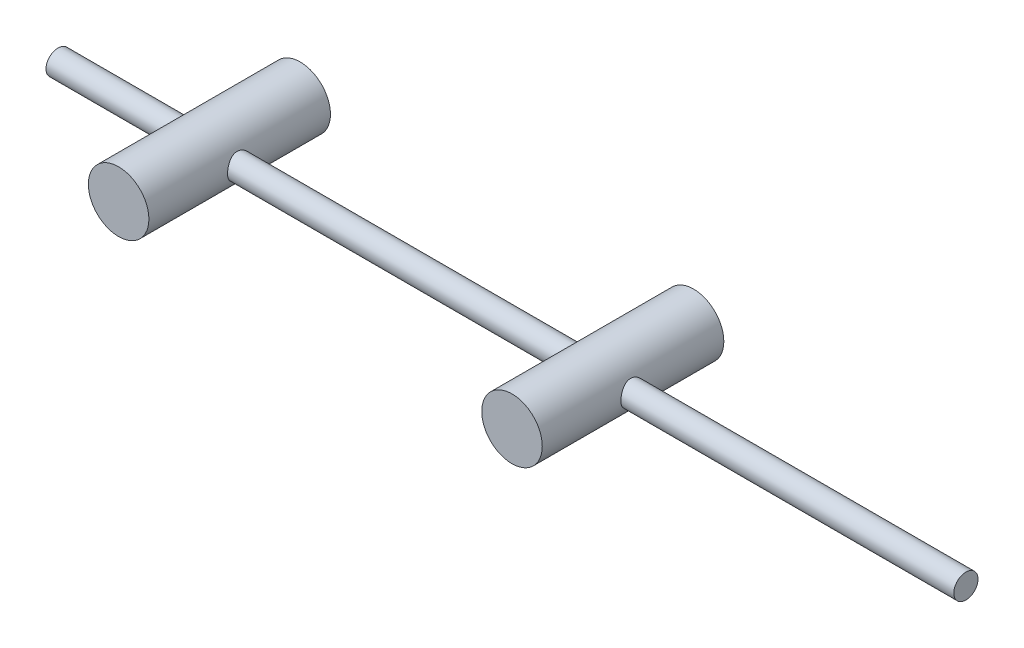
ISO-10303-21;
HEADER;
FILE_DESCRIPTION(('STEP AP214'),'2;1');
FILE_NAME('part.step','',(''),(''),'','','');
FILE_SCHEMA(('AUTOMOTIVE_DESIGN { 1 0 10303 214 1 1 1 1 }'));
ENDSEC;
DATA;
#1=APPLICATION_CONTEXT('core data for automotive mechanical design processes');
#2=APPLICATION_PROTOCOL_DEFINITION('international standard','automotive_design',2000,#1);
#3=PRODUCT_CONTEXT('',#1,'mechanical');
#4=PRODUCT('Part','Part','',(#3));
#5=PRODUCT_RELATED_PRODUCT_CATEGORY('part','',(#4));
#6=PRODUCT_DEFINITION_FORMATION('','',#4);
#7=PRODUCT_DEFINITION_CONTEXT('part definition',#1,'design');
#8=PRODUCT_DEFINITION('design','',#6,#7);
#9=PRODUCT_DEFINITION_SHAPE('','',#8);
#10=(LENGTH_UNIT() NAMED_UNIT(*) SI_UNIT(.MILLI.,.METRE.));
#11=(NAMED_UNIT(*) PLANE_ANGLE_UNIT() SI_UNIT($,.RADIAN.));
#12=(NAMED_UNIT(*) SI_UNIT($,.STERADIAN.) SOLID_ANGLE_UNIT());
#13=UNCERTAINTY_MEASURE_WITH_UNIT(LENGTH_MEASURE(1.E-05),#10,'distance_accuracy_value','');
#14=(GEOMETRIC_REPRESENTATION_CONTEXT(3) GLOBAL_UNCERTAINTY_ASSIGNED_CONTEXT((#13)) GLOBAL_UNIT_ASSIGNED_CONTEXT((#10,
#11,#12)) REPRESENTATION_CONTEXT('',''));
#15=CARTESIAN_POINT('',(0.,0.,0.));
#16=DIRECTION('',(0.,0.,1.));
#17=DIRECTION('',(1.,0.,0.));
#18=AXIS2_PLACEMENT_3D('',#15,#16,#17);
#19=CARTESIAN_POINT('',(0.,0.,0.));
#20=DIRECTION('',(-1.,0.,0.));
#21=DIRECTION('',(0.,0.,1.));
#22=AXIS2_PLACEMENT_3D('',#19,#20,#21);
#23=CYLINDRICAL_SURFACE('',#22,2.);
#24=CARTESIAN_POINT('',(85.,0.,2.));
#25=CARTESIAN_POINT('',(85.0000072877292,-0.107493005442892,1.99999014817628));
#26=CARTESIAN_POINT('',(85.0035070569307,-0.215172564090674,1.99128224791163));
#27=CARTESIAN_POINT('',(85.0171654689936,-0.427496480417897,1.95675229647877));
#28=CARTESIAN_POINT('',(85.0273422130112,-0.532131777561249,1.93088372091387));
#29=CARTESIAN_POINT('',(85.0532579078688,-0.734953922727404,1.86312392194117));
#30=CARTESIAN_POINT('',(85.0689786363593,-0.833160661616961,1.82128515378327));
#31=CARTESIAN_POINT('',(85.1044338920392,-1.02107197032837,1.72298082667346));
#32=CARTESIAN_POINT('',(85.1241670254194,-1.11077947675099,1.66652034508107));
#33=CARTESIAN_POINT('',(85.1666911382958,-1.2835010075704,1.53776450143907));
#34=CARTESIAN_POINT('',(85.1895770307081,-1.36606227255022,1.46489334375974));
#35=CARTESIAN_POINT('',(85.2353942309381,-1.51817500478473,1.30659999652322));
#36=CARTESIAN_POINT('',(85.2583255554621,-1.58772010713354,1.22117170278826));
#37=CARTESIAN_POINT('',(85.3027720820287,-1.71487456729288,1.03557192975774));
#38=CARTESIAN_POINT('',(85.3241788403505,-1.77181498119548,0.934913513976805));
#39=CARTESIAN_POINT('',(85.3616635281321,-1.86775471903715,0.72446360157996));
#40=CARTESIAN_POINT('',(85.3777439875582,-1.90676256428584,0.614676472151642));
#41=CARTESIAN_POINT('',(85.4017364233918,-1.96389882339587,0.3942876664079));
#42=CARTESIAN_POINT('',(85.409985796444,-1.98289396580565,0.283948764423788));
#43=CARTESIAN_POINT('',(85.4183599595086,-2.00217296164003,0.0613650016927327));
#44=CARTESIAN_POINT('',(85.4184887447723,-2.00246601631323,-0.0508788946250148));
#45=CARTESIAN_POINT('',(85.4108949972001,-1.98498936750455,-0.265756671458044));
#46=CARTESIAN_POINT('',(85.4037182496155,-1.96847531430514,-0.368515714409031));
#47=CARTESIAN_POINT('',(85.3832381239217,-1.91994688029782,-0.569659556006714));
#48=CARTESIAN_POINT('',(85.3699336767833,-1.88792979480464,-0.668043588110308));
#49=CARTESIAN_POINT('',(85.3384051491147,-1.80869473255108,-0.860017836196042));
#50=CARTESIAN_POINT('',(85.3200862071921,-1.76117986231532,-0.953469239054692));
#51=CARTESIAN_POINT('',(85.2806188361011,-1.65250646073222,-1.13141581636157));
#52=CARTESIAN_POINT('',(85.2594693454315,-1.59134280510085,-1.21590760940281));
#53=CARTESIAN_POINT('',(85.2147326325773,-1.45155059945444,-1.380409728802));
#54=CARTESIAN_POINT('',(85.1910833502385,-1.37193746297064,-1.45956872944602));
#55=CARTESIAN_POINT('',(85.1454017504172,-1.2003144274302,-1.60368447800204));
#56=CARTESIAN_POINT('',(85.1233697555468,-1.10830206533444,-1.6686383974103));
#57=CARTESIAN_POINT('',(85.0828531873545,-0.912077652605846,-1.78361744741584));
#58=CARTESIAN_POINT('',(85.0644472990459,-0.807660491346481,-1.83332228119706));
#59=CARTESIAN_POINT('',(85.0338517167124,-0.591023765482885,-1.91416786107806));
#60=CARTESIAN_POINT('',(85.0216588653762,-0.478808196849676,-1.94531803755741));
#61=CARTESIAN_POINT('',(85.0054386049309,-0.256895887607821,-1.98644829541971));
#62=CARTESIAN_POINT('',(85.0009705416649,-0.147443293985535,-1.99757245425356));
#63=CARTESIAN_POINT('',(84.9993152148937,0.0718453098078165,-2.00171310052862));
#64=CARTESIAN_POINT('',(85.0021260641771,0.181681213223923,-1.99473428154751));
#65=CARTESIAN_POINT('',(85.0144243293625,0.393432739121987,-1.96370824744801));
#66=CARTESIAN_POINT('',(85.0236060865448,0.495482491775473,-1.94044201964903));
#67=CARTESIAN_POINT('',(85.047405585945,0.69413542806078,-1.87856429169019));
#68=CARTESIAN_POINT('',(85.0620240264347,0.790737910224845,-1.83995082033132));
#69=CARTESIAN_POINT('',(85.0958340522919,0.979078785816704,-1.74721506032005));
#70=CARTESIAN_POINT('',(85.115151840202,1.07057802275541,-1.69265452795686));
#71=CARTESIAN_POINT('',(85.1562663525448,1.24344359124656,-1.57005967609436));
#72=CARTESIAN_POINT('',(85.1780640688973,1.32480584076113,-1.50201995707739));
#73=CARTESIAN_POINT('',(85.2235488236189,1.48072304302882,-1.34912998705038));
#74=CARTESIAN_POINT('',(85.2472655857495,1.55447393380607,-1.2634664584938));
#75=CARTESIAN_POINT('',(85.2925832708287,1.68675119741371,-1.08055991699064));
#76=CARTESIAN_POINT('',(85.3141838447349,1.74527506133751,-0.983314999660057));
#77=CARTESIAN_POINT('',(85.3528570009229,1.84580750193163,-0.7785383054059));
#78=CARTESIAN_POINT('',(85.3698836911521,1.88765059453446,-0.670916000787694));
#79=CARTESIAN_POINT('',(85.3967632652207,1.95229621970531,-0.449266348284848));
#80=CARTESIAN_POINT('',(85.40662144304,1.97511280526932,-0.335243794187577));
#81=CARTESIAN_POINT('',(85.4172824070008,1.99971561727841,-0.112872098225459));
#82=CARTESIAN_POINT('',(85.4186857899183,2.00289708230287,-0.00470516040665075));
#83=CARTESIAN_POINT('',(85.413851639669,1.99180315927753,0.210544857713292));
#84=CARTESIAN_POINT('',(85.4076150767521,1.97752998791379,0.317628073902583));
#85=CARTESIAN_POINT('',(85.3887335092098,1.93307136615365,0.523332189855041));
#86=CARTESIAN_POINT('',(85.3763516817255,1.90353749357098,0.622120274432998));
#87=CARTESIAN_POINT('',(85.3467599876731,1.83000544849102,0.813378629613482));
#88=CARTESIAN_POINT('',(85.3295487879399,1.78600328139382,0.905847146899825));
#89=CARTESIAN_POINT('',(85.2910139039551,1.68187276275973,1.08760961927078));
#90=CARTESIAN_POINT('',(85.2695111768676,1.62096533515949,1.17641867013049));
#91=CARTESIAN_POINT('',(85.2253619562776,1.4858921192715,1.34299331720376));
#92=CARTESIAN_POINT('',(85.2027151195159,1.41172233481812,1.42075557212832));
#93=CARTESIAN_POINT('',(85.1570643291261,1.24650550627247,1.56820285326362));
#94=CARTESIAN_POINT('',(85.1341324203782,1.15467600114614,1.63703730689807));
#95=CARTESIAN_POINT('',(85.0919959328628,0.959900320285782,1.75833704262164));
#96=CARTESIAN_POINT('',(85.072793089071,0.856949004547241,1.81079471215253));
#97=CARTESIAN_POINT('',(85.0406028518414,0.644738062495207,1.89662221519029));
#98=CARTESIAN_POINT('',(85.0275063694497,0.5356316182197,1.93032932356034));
#99=CARTESIAN_POINT('',(85.0085569379063,0.312876546281224,1.97863912095427));
#100=CARTESIAN_POINT('',(85.0026810050436,0.199243525858916,1.9933024367439));
#101=CARTESIAN_POINT('',(85.0002410049586,0.0569122978909324,1.99939538097828));
#102=CARTESIAN_POINT('',(84.9999980703083,0.0284626887407597,2.0000026086292));
#103=CARTESIAN_POINT('',(85.,0.,2.));
#104=B_SPLINE_CURVE_WITH_KNOTS('',3,(#24,#25,#26,#27,#28,#29,#30,#31,#32,#33,#34,#35,#36,#37,
#38,#39,#40,#41,#42,#43,#44,#45,#46,#47,#48,#49,#50,#51,#52,#53,#54,#55,#56,#57,#58,#59,#60,#61,
#62,#63,#64,#65,#66,#67,#68,#69,#70,#71,#72,#73,#74,#75,#76,#77,#78,#79,#80,#81,#82,#83,#84,#85,
#86,#87,#88,#89,#90,#91,#92,#93,#94,#95,#96,#97,#98,#99,#100,#101,#102,#103),.UNSPECIFIED.,.T.,
.F.,(4,2,2,2,2,2,2,2,2,2,2,2,2,2,2,2,2,2,2,2,2,2,2,2,2,2,2,2,2,2,2,2,2,2,2,2,2,2,2,4),(0.,
0.322402987893072,0.645683636007936,0.967911457471582,1.29002753567984,1.62597381700398,
1.96208394934412,2.31315258819217,2.66405423118269,2.99904105308829,3.33386306340489,
3.64538328401373,3.95695787256048,4.27489126298817,4.59294421938184,4.93558349186557,
5.27829092839734,5.62776913162808,5.97706956113792,6.30569184528009,6.63422893570084,
6.94800455564367,7.26182048993798,7.58523513398264,7.90877959498971,8.25368474624415,
8.59864669043749,8.94695045140829,9.29499672645936,9.6179967339275,9.94095572563048,
10.2511431854877,10.5614163580516,10.8894546805669,11.217592013484,11.5670042353384,
11.9165786364054,12.2596430101332,12.6016125240434,12.686980458968),.UNSPECIFIED.);
#105=CARTESIAN_POINT('',(85.,0.,2.));
#106=VERTEX_POINT('',#105);
#107=EDGE_CURVE('E50',#106,#106,#104,.T.);
#108=ORIENTED_EDGE('',*,*,#107,.F.);
#109=EDGE_LOOP('',(#108));
#110=FACE_BOUND('',#109,.T.);
#111=CARTESIAN_POINT('',(30.,0.,2.));
#112=CARTESIAN_POINT('',(29.9999927122708,0.107493005442892,1.99999014817628));
#113=CARTESIAN_POINT('',(29.9964929430693,0.215172564090674,1.99128224791163));
#114=CARTESIAN_POINT('',(29.9828345310064,0.427496480417897,1.95675229647877));
#115=CARTESIAN_POINT('',(29.9726577869888,0.532131777561249,1.93088372091387));
#116=CARTESIAN_POINT('',(29.9467420921312,0.734953922727404,1.86312392194117));
#117=CARTESIAN_POINT('',(29.9310213636407,0.833160661616961,1.82128515378327));
#118=CARTESIAN_POINT('',(29.8955661079608,1.02107197032837,1.72298082667346));
#119=CARTESIAN_POINT('',(29.8758329745806,1.11077947675099,1.66652034508107));
#120=CARTESIAN_POINT('',(29.8333088617042,1.2835010075704,1.53776450143907));
#121=CARTESIAN_POINT('',(29.8104229692919,1.36606227255022,1.46489334375974));
#122=CARTESIAN_POINT('',(29.7646057690619,1.51817500478473,1.30659999652322));
#123=CARTESIAN_POINT('',(29.7416744445379,1.58772010713354,1.22117170278826));
#124=CARTESIAN_POINT('',(29.6972279179714,1.71487456729288,1.03557192975774));
#125=CARTESIAN_POINT('',(29.6758211596495,1.77181498119548,0.934913513976805));
#126=CARTESIAN_POINT('',(29.6383364718679,1.86775471903715,0.724463601579959));
#127=CARTESIAN_POINT('',(29.6222560124417,1.90676256428584,0.614676472151641));
#128=CARTESIAN_POINT('',(29.5982635766082,1.96389882339587,0.394287666407899));
#129=CARTESIAN_POINT('',(29.590014203556,1.98289396580565,0.283948764423788));
#130=CARTESIAN_POINT('',(29.5816400404914,2.00217296164003,0.0613650016927328));
#131=CARTESIAN_POINT('',(29.5815112552277,2.00246601631323,-0.0508788946250147));
#132=CARTESIAN_POINT('',(29.5891050027999,1.98498936750455,-0.265756671458044));
#133=CARTESIAN_POINT('',(29.5962817503845,1.96847531430514,-0.368515714409032));
#134=CARTESIAN_POINT('',(29.6167618760783,1.91994688029782,-0.569659556006715));
#135=CARTESIAN_POINT('',(29.6300663232167,1.88792979480464,-0.668043588110309));
#136=CARTESIAN_POINT('',(29.6615948508853,1.80869473255108,-0.860017836196043));
#137=CARTESIAN_POINT('',(29.6799137928079,1.76117986231532,-0.953469239054692));
#138=CARTESIAN_POINT('',(29.7193811638989,1.65250646073222,-1.13141581636157));
#139=CARTESIAN_POINT('',(29.7405306545685,1.59134280510085,-1.21590760940281));
#140=CARTESIAN_POINT('',(29.7852673674227,1.45155059945444,-1.380409728802));
#141=CARTESIAN_POINT('',(29.8089166497615,1.37193746297064,-1.45956872944602));
#142=CARTESIAN_POINT('',(29.8545982495828,1.2003144274302,-1.60368447800204));
#143=CARTESIAN_POINT('',(29.8766302444532,1.10830206533444,-1.6686383974103));
#144=CARTESIAN_POINT('',(29.9171468126455,0.912077652605845,-1.78361744741584));
#145=CARTESIAN_POINT('',(29.9355527009541,0.80766049134648,-1.83332228119706));
#146=CARTESIAN_POINT('',(29.9661482832876,0.591023765482885,-1.91416786107806));
#147=CARTESIAN_POINT('',(29.9783411346238,0.478808196849676,-1.94531803755741));
#148=CARTESIAN_POINT('',(29.9945613950691,0.256895887607822,-1.98644829541971));
#149=CARTESIAN_POINT('',(29.9990294583351,0.147443293985536,-1.99757245425356));
#150=CARTESIAN_POINT('',(30.0006847851063,-0.0718453098078164,-2.00171310052862));
#151=CARTESIAN_POINT('',(29.9978739358229,-0.181681213223923,-1.99473428154751));
#152=CARTESIAN_POINT('',(29.9855756706375,-0.393432739121988,-1.96370824744801));
#153=CARTESIAN_POINT('',(29.9763939134552,-0.495482491775475,-1.94044201964903));
#154=CARTESIAN_POINT('',(29.952594414055,-0.694135428060781,-1.87856429169019));
#155=CARTESIAN_POINT('',(29.9379759735653,-0.790737910224846,-1.83995082033132));
#156=CARTESIAN_POINT('',(29.9041659477081,-0.979078785816704,-1.74721506032006));
#157=CARTESIAN_POINT('',(29.884848159798,-1.07057802275541,-1.69265452795686));
#158=CARTESIAN_POINT('',(29.8437336474552,-1.24344359124656,-1.57005967609436));
#159=CARTESIAN_POINT('',(29.8219359311027,-1.32480584076113,-1.50201995707739));
#160=CARTESIAN_POINT('',(29.7764511763811,-1.48072304302882,-1.34912998705038));
#161=CARTESIAN_POINT('',(29.7527344142505,-1.55447393380607,-1.26346645849379));
#162=CARTESIAN_POINT('',(29.7074167291713,-1.68675119741371,-1.08055991699064));
#163=CARTESIAN_POINT('',(29.6858161552651,-1.74527506133751,-0.983314999660055));
#164=CARTESIAN_POINT('',(29.6471429990771,-1.84580750193163,-0.778538305405897));
#165=CARTESIAN_POINT('',(29.6301163088479,-1.88765059453446,-0.670916000787691));
#166=CARTESIAN_POINT('',(29.6032367347793,-1.95229621970531,-0.449266348284846));
#167=CARTESIAN_POINT('',(29.59337855696,-1.97511280526932,-0.335243794187575));
#168=CARTESIAN_POINT('',(29.5827175929993,-1.99971561727841,-0.112872098225458));
#169=CARTESIAN_POINT('',(29.5813142100817,-2.00289708230287,-0.00470516040664989));
#170=CARTESIAN_POINT('',(29.586148360331,-1.99180315927753,0.210544857713293));
#171=CARTESIAN_POINT('',(29.5923849232479,-1.97752998791379,0.317628073902584));
#172=CARTESIAN_POINT('',(29.6112664907902,-1.93307136615365,0.523332189855042));
#173=CARTESIAN_POINT('',(29.6236483182745,-1.90353749357098,0.622120274432998));
#174=CARTESIAN_POINT('',(29.653240012327,-1.83000544849102,0.813378629613483));
#175=CARTESIAN_POINT('',(29.6704512120601,-1.78600328139382,0.905847146899827));
#176=CARTESIAN_POINT('',(29.7089860960449,-1.68187276275973,1.08760961927078));
#177=CARTESIAN_POINT('',(29.7304888231324,-1.62096533515949,1.17641867013049));
#178=CARTESIAN_POINT('',(29.7746380437224,-1.4858921192715,1.34299331720376));
#179=CARTESIAN_POINT('',(29.7972848804841,-1.41172233481812,1.42075557212832));
#180=CARTESIAN_POINT('',(29.8429356708739,-1.24650550627247,1.56820285326362));
#181=CARTESIAN_POINT('',(29.8658675796218,-1.15467600114614,1.63703730689807));
#182=CARTESIAN_POINT('',(29.9080040671372,-0.959900320285782,1.75833704262164));
#183=CARTESIAN_POINT('',(29.9272069109291,-0.85694900454724,1.81079471215253));
#184=CARTESIAN_POINT('',(29.9593971481586,-0.644738062495206,1.89662221519029));
#185=CARTESIAN_POINT('',(29.9724936305503,-0.535631618219698,1.93032932356034));
#186=CARTESIAN_POINT('',(29.9914430620936,-0.312876546281223,1.97863912095427));
#187=CARTESIAN_POINT('',(29.9973189949564,-0.199243525858914,1.9933024367439));
#188=CARTESIAN_POINT('',(29.9997589950414,-0.0569122978909305,1.99939538097828));
#189=CARTESIAN_POINT('',(30.0000019296917,-0.0284626887407588,2.0000026086292));
#190=CARTESIAN_POINT('',(30.,0.,2.));
#191=B_SPLINE_CURVE_WITH_KNOTS('',3,(#111,#112,#113,#114,#115,#116,#117,#118,#119,#120,#121,
#122,#123,#124,#125,#126,#127,#128,#129,#130,#131,#132,#133,#134,#135,#136,#137,#138,#139,#140,
#141,#142,#143,#144,#145,#146,#147,#148,#149,#150,#151,#152,#153,#154,#155,#156,#157,#158,#159,
#160,#161,#162,#163,#164,#165,#166,#167,#168,#169,#170,#171,#172,#173,#174,#175,#176,#177,#178,
#179,#180,#181,#182,#183,#184,#185,#186,#187,#188,#189,#190),.UNSPECIFIED.,.T.,.F.,(4,2,2,2,2,2,
2,2,2,2,2,2,2,2,2,2,2,2,2,2,2,2,2,2,2,2,2,2,2,2,2,2,2,2,2,2,2,2,2,4),(0.,0.322402987893072,
0.645683636007935,0.967911457471583,1.29002753567984,1.62597381700398,1.96208394934412,
2.31315258819217,2.66405423118269,2.99904105308829,3.33386306340489,3.64538328401373,
3.95695787256048,4.27489126298817,4.59294421938184,4.93558349186558,5.27829092839734,
5.62776913162808,5.97706956113792,6.30569184528009,6.63422893570084,6.94800455564367,
7.26182048993798,7.58523513398264,7.90877959498971,8.25368474624415,8.5986466904375,
8.94695045140829,9.29499672645936,9.6179967339275,9.94095572563048,10.2511431854877,
10.5614163580516,10.8894546805669,11.217592013484,11.5670042353384,11.9165786364054,
12.2596430101332,12.6016125240434,12.686980458968),.UNSPECIFIED.);
#192=CARTESIAN_POINT('',(30.,0.,2.));
#193=VERTEX_POINT('',#192);
#194=EDGE_CURVE('E10',#193,#193,#191,.T.);
#195=ORIENTED_EDGE('',*,*,#194,.F.);
#196=EDGE_LOOP('',(#195));
#197=FACE_BOUND('',#196,.T.);
#198=ADVANCED_FACE('F32',(#110,#197),#23,.T.);
#199=CARTESIAN_POINT('',(150.,0.,0.));
#200=DIRECTION('',(-1.,0.,0.));
#201=DIRECTION('',(0.,0.,1.));
#202=AXIS2_PLACEMENT_3D('',#199,#200,#201);
#203=CIRCLE('',#202,2.00000000000001);
#204=CARTESIAN_POINT('',(150.,0.,2.00000000000001));
#205=VERTEX_POINT('',#204);
#206=EDGE_CURVE('E87',#205,#205,#203,.T.);
#207=ORIENTED_EDGE('',*,*,#206,.T.);
#208=EDGE_LOOP('',(#207));
#209=FACE_BOUND('',#208,.T.);
#210=CARTESIAN_POINT('',(95.,0.,2.));
#211=CARTESIAN_POINT('',(94.9999927122708,0.107493005442892,1.99999014817628));
#212=CARTESIAN_POINT('',(94.9964929430693,0.215172564090674,1.99128224791163));
#213=CARTESIAN_POINT('',(94.9828345310064,0.427496480417897,1.95675229647877));
#214=CARTESIAN_POINT('',(94.9726577869887,0.532131777561249,1.93088372091387));
#215=CARTESIAN_POINT('',(94.9467420921312,0.734953922727403,1.86312392194117));
#216=CARTESIAN_POINT('',(94.9310213636407,0.833160661616959,1.82128515378327));
#217=CARTESIAN_POINT('',(94.8955661079608,1.02107197032837,1.72298082667346));
#218=CARTESIAN_POINT('',(94.8758329745805,1.11077947675099,1.66652034508107));
#219=CARTESIAN_POINT('',(94.8333088617042,1.28350100757039,1.53776450143907));
#220=CARTESIAN_POINT('',(94.8104229692919,1.36606227255021,1.46489334375974));
#221=CARTESIAN_POINT('',(94.7646057690619,1.51817500478472,1.30659999652323));
#222=CARTESIAN_POINT('',(94.7416744445379,1.58772010713353,1.22117170278826));
#223=CARTESIAN_POINT('',(94.6972279179713,1.71487456729288,1.03557192975774));
#224=CARTESIAN_POINT('',(94.6758211596495,1.77181498119548,0.934913513976805));
#225=CARTESIAN_POINT('',(94.6383364718679,1.86775471903715,0.72446360157996));
#226=CARTESIAN_POINT('',(94.6222560124417,1.90676256428584,0.614676472151642));
#227=CARTESIAN_POINT('',(94.5982635766082,1.96389882339587,0.3942876664079));
#228=CARTESIAN_POINT('',(94.590014203556,1.98289396580565,0.283948764423788));
#229=CARTESIAN_POINT('',(94.5816400404914,2.00217296164003,0.0613650016927327));
#230=CARTESIAN_POINT('',(94.5815112552277,2.00246601631323,-0.0508788946250148));
#231=CARTESIAN_POINT('',(94.5891050027999,1.98498936750455,-0.265756671458044));
#232=CARTESIAN_POINT('',(94.5962817503845,1.96847531430514,-0.368515714409031));
#233=CARTESIAN_POINT('',(94.6167618760783,1.91994688029782,-0.569659556006714));
#234=CARTESIAN_POINT('',(94.6300663232167,1.88792979480464,-0.668043588110308));
#235=CARTESIAN_POINT('',(94.6615948508853,1.80869473255108,-0.860017836196042));
#236=CARTESIAN_POINT('',(94.6799137928079,1.76117986231532,-0.953469239054692));
#237=CARTESIAN_POINT('',(94.7193811638989,1.65250646073222,-1.13141581636157));
#238=CARTESIAN_POINT('',(94.7405306545685,1.59134280510085,-1.21590760940281));
#239=CARTESIAN_POINT('',(94.7852673674227,1.45155059945444,-1.380409728802));
#240=CARTESIAN_POINT('',(94.8089166497615,1.37193746297064,-1.45956872944602));
#241=CARTESIAN_POINT('',(94.8545982495828,1.2003144274302,-1.60368447800204));
#242=CARTESIAN_POINT('',(94.8766302444532,1.10830206533444,-1.6686383974103));
#243=CARTESIAN_POINT('',(94.9171468126455,0.912077652605845,-1.78361744741584));
#244=CARTESIAN_POINT('',(94.9355527009541,0.807660491346479,-1.83332228119706));
#245=CARTESIAN_POINT('',(94.9661482832876,0.591023765482884,-1.91416786107806));
#246=CARTESIAN_POINT('',(94.9783411346238,0.478808196849675,-1.94531803755741));
#247=CARTESIAN_POINT('',(94.9945613950691,0.256895887607821,-1.98644829541971));
#248=CARTESIAN_POINT('',(94.9990294583351,0.147443293985535,-1.99757245425356));
#249=CARTESIAN_POINT('',(95.0006847851063,-0.0718453098078165,-2.00171310052862));
#250=CARTESIAN_POINT('',(94.9978739358229,-0.181681213223923,-1.99473428154751));
#251=CARTESIAN_POINT('',(94.9855756706375,-0.393432739121987,-1.96370824744801));
#252=CARTESIAN_POINT('',(94.9763939134552,-0.495482491775473,-1.94044201964903));
#253=CARTESIAN_POINT('',(94.952594414055,-0.69413542806078,-1.87856429169019));
#254=CARTESIAN_POINT('',(94.9379759735653,-0.790737910224845,-1.83995082033132));
#255=CARTESIAN_POINT('',(94.9041659477081,-0.979078785816704,-1.74721506032005));
#256=CARTESIAN_POINT('',(94.884848159798,-1.07057802275541,-1.69265452795686));
#257=CARTESIAN_POINT('',(94.8437336474552,-1.24344359124656,-1.57005967609436));
#258=CARTESIAN_POINT('',(94.8219359311027,-1.32480584076113,-1.50201995707739));
#259=CARTESIAN_POINT('',(94.7764511763811,-1.48072304302882,-1.34912998705038));
#260=CARTESIAN_POINT('',(94.7527344142505,-1.55447393380607,-1.2634664584938));
#261=CARTESIAN_POINT('',(94.7074167291713,-1.68675119741371,-1.08055991699064));
#262=CARTESIAN_POINT('',(94.6858161552651,-1.74527506133751,-0.983314999660058));
#263=CARTESIAN_POINT('',(94.6471429990771,-1.84580750193163,-0.778538305405901));
#264=CARTESIAN_POINT('',(94.6301163088479,-1.88765059453446,-0.670916000787695));
#265=CARTESIAN_POINT('',(94.6032367347793,-1.95229621970531,-0.449266348284849));
#266=CARTESIAN_POINT('',(94.59337855696,-1.97511280526932,-0.335243794187578));
#267=CARTESIAN_POINT('',(94.5827175929992,-1.99971561727841,-0.112872098225459));
#268=CARTESIAN_POINT('',(94.5813142100817,-2.00289708230287,-0.00470516040665075));
#269=CARTESIAN_POINT('',(94.586148360331,-1.99180315927753,0.210544857713292));
#270=CARTESIAN_POINT('',(94.5923849232479,-1.97752998791379,0.317628073902583));
#271=CARTESIAN_POINT('',(94.6112664907902,-1.93307136615365,0.523332189855041));
#272=CARTESIAN_POINT('',(94.6236483182745,-1.90353749357098,0.622120274432998));
#273=CARTESIAN_POINT('',(94.6532400123269,-1.83000544849102,0.813378629613482));
#274=CARTESIAN_POINT('',(94.6704512120601,-1.78600328139382,0.905847146899825));
#275=CARTESIAN_POINT('',(94.7089860960449,-1.68187276275973,1.08760961927078));
#276=CARTESIAN_POINT('',(94.7304888231324,-1.62096533515949,1.17641867013049));
#277=CARTESIAN_POINT('',(94.7746380437223,-1.4858921192715,1.34299331720376));
#278=CARTESIAN_POINT('',(94.7972848804841,-1.41172233481812,1.42075557212832));
#279=CARTESIAN_POINT('',(94.8429356708739,-1.24650550627247,1.56820285326362));
#280=CARTESIAN_POINT('',(94.8658675796218,-1.15467600114614,1.63703730689807));
#281=CARTESIAN_POINT('',(94.9080040671371,-0.959900320285782,1.75833704262164));
#282=CARTESIAN_POINT('',(94.927206910929,-0.856949004547241,1.81079471215253));
#283=CARTESIAN_POINT('',(94.9593971481586,-0.644738062495207,1.89662221519029));
#284=CARTESIAN_POINT('',(94.9724936305503,-0.5356316182197,1.93032932356034));
#285=CARTESIAN_POINT('',(94.9914430620937,-0.312876546281224,1.97863912095427));
#286=CARTESIAN_POINT('',(94.9973189949564,-0.199243525858916,1.9933024367439));
#287=CARTESIAN_POINT('',(94.9997589950414,-0.0569122978909324,1.99939538097828));
#288=CARTESIAN_POINT('',(95.0000019296917,-0.0284626887407597,2.0000026086292));
#289=CARTESIAN_POINT('',(95.,0.,2.));
#290=B_SPLINE_CURVE_WITH_KNOTS('',3,(#210,#211,#212,#213,#214,#215,#216,#217,#218,#219,#220,
#221,#222,#223,#224,#225,#226,#227,#228,#229,#230,#231,#232,#233,#234,#235,#236,#237,#238,#239,
#240,#241,#242,#243,#244,#245,#246,#247,#248,#249,#250,#251,#252,#253,#254,#255,#256,#257,#258,
#259,#260,#261,#262,#263,#264,#265,#266,#267,#268,#269,#270,#271,#272,#273,#274,#275,#276,#277,
#278,#279,#280,#281,#282,#283,#284,#285,#286,#287,#288,#289),.UNSPECIFIED.,.T.,.F.,(4,2,2,2,2,2,
2,2,2,2,2,2,2,2,2,2,2,2,2,2,2,2,2,2,2,2,2,2,2,2,2,2,2,2,2,2,2,2,2,4),(0.,0.322402987893072,
0.645683636007936,0.96791145747158,1.29002753567984,1.62597381700397,1.96208394934412,
2.31315258819217,2.66405423118269,2.99904105308829,3.33386306340489,3.64538328401373,
3.95695787256048,4.27489126298817,4.59294421938184,4.93558349186558,5.27829092839734,
5.62776913162808,5.97706956113792,6.30569184528009,6.63422893570084,6.94800455564367,
7.26182048993798,7.58523513398265,7.90877959498971,8.25368474624415,8.5986466904375,
8.94695045140829,9.29499672645936,9.6179967339275,9.94095572563048,10.2511431854877,
10.5614163580516,10.8894546805669,11.217592013484,11.5670042353384,11.9165786364054,
12.2596430101332,12.6016125240435,12.686980458968),.UNSPECIFIED.);
#291=CARTESIAN_POINT('',(95.,0.,2.));
#292=VERTEX_POINT('',#291);
#293=EDGE_CURVE('E46',#292,#292,#290,.T.);
#294=ORIENTED_EDGE('',*,*,#293,.F.);
#295=EDGE_LOOP('',(#294));
#296=FACE_BOUND('',#295,.T.);
#297=ADVANCED_FACE('F58',(#209,#296),#23,.T.);
#298=CARTESIAN_POINT('',(150.,0.,0.));
#299=DIRECTION('',(-1.,0.,0.));
#300=DIRECTION('',(0.,0.,1.));
#301=AXIS2_PLACEMENT_3D('',#298,#299,#300);
#302=PLANE('',#301);
#303=ORIENTED_EDGE('',*,*,#206,.F.);
#304=EDGE_LOOP('',(#303));
#305=FACE_BOUND('',#304,.T.);
#306=ADVANCED_FACE('F34',(#305),#302,.F.);
#307=CARTESIAN_POINT('',(90.,0.,15.));
#308=DIRECTION('',(0.,0.,-1.));
#309=DIRECTION('',(-1.,0.,0.));
#310=AXIS2_PLACEMENT_3D('',#307,#308,#309);
#311=CYLINDRICAL_SURFACE('',#310,4.99999999999999);
#312=ORIENTED_EDGE('',*,*,#107,.T.);
#313=EDGE_LOOP('',(#312));
#314=FACE_BOUND('',#313,.T.);
#315=CARTESIAN_POINT('',(90.,0.,15.));
#316=DIRECTION('',(0.,0.,1.));
#317=DIRECTION('',(1.,0.,0.));
#318=AXIS2_PLACEMENT_3D('',#315,#316,#317);
#319=CIRCLE('',#318,4.99999999999999);
#320=CARTESIAN_POINT('',(95.,0.,15.));
#321=VERTEX_POINT('',#320);
#322=EDGE_CURVE('E93',#321,#321,#319,.T.);
#323=ORIENTED_EDGE('',*,*,#322,.F.);
#324=EDGE_LOOP('',(#323));
#325=FACE_BOUND('',#324,.T.);
#326=CARTESIAN_POINT('',(90.,0.,-15.));
#327=DIRECTION('',(0.,0.,1.));
#328=DIRECTION('',(1.,0.,0.));
#329=AXIS2_PLACEMENT_3D('',#326,#327,#328);
#330=CIRCLE('',#329,4.99999999999999);
#331=CARTESIAN_POINT('',(95.,0.,-15.));
#332=VERTEX_POINT('',#331);
#333=EDGE_CURVE('E94',#332,#332,#330,.T.);
#334=ORIENTED_EDGE('',*,*,#333,.T.);
#335=EDGE_LOOP('',(#334));
#336=FACE_BOUND('',#335,.T.);
#337=ORIENTED_EDGE('',*,*,#293,.T.);
#338=EDGE_LOOP('',(#337));
#339=FACE_BOUND('',#338,.T.);
#340=ADVANCED_FACE('F74',(#314,#325,#336,#339),#311,.T.);
#341=CARTESIAN_POINT('',(90.,0.,15.));
#342=DIRECTION('',(0.,0.,1.));
#343=DIRECTION('',(1.,0.,0.));
#344=AXIS2_PLACEMENT_3D('',#341,#342,#343);
#345=PLANE('',#344);
#346=ORIENTED_EDGE('',*,*,#322,.T.);
#347=EDGE_LOOP('',(#346));
#348=FACE_BOUND('',#347,.T.);
#349=ADVANCED_FACE('F70',(#348),#345,.T.);
#350=CARTESIAN_POINT('',(90.,0.,-15.));
#351=DIRECTION('',(0.,0.,1.));
#352=DIRECTION('',(1.,0.,0.));
#353=AXIS2_PLACEMENT_3D('',#350,#351,#352);
#354=PLANE('',#353);
#355=ORIENTED_EDGE('',*,*,#333,.F.);
#356=EDGE_LOOP('',(#355));
#357=FACE_BOUND('',#356,.T.);
#358=ADVANCED_FACE('F67',(#357),#354,.F.);
#359=CARTESIAN_POINT('',(25.,0.,15.));
#360=DIRECTION('',(0.,0.,-1.));
#361=DIRECTION('',(-1.,0.,0.));
#362=AXIS2_PLACEMENT_3D('',#359,#360,#361);
#363=CYLINDRICAL_SURFACE('',#362,5.);
#364=CARTESIAN_POINT('',(20.,0.,2.));
#365=CARTESIAN_POINT('',(20.0000072877292,-0.107493005442892,1.99999014817628));
#366=CARTESIAN_POINT('',(20.0035070569307,-0.215172564090674,1.99128224791163));
#367=CARTESIAN_POINT('',(20.0171654689936,-0.427496480417897,1.95675229647877));
#368=CARTESIAN_POINT('',(20.0273422130112,-0.532131777561249,1.93088372091387));
#369=CARTESIAN_POINT('',(20.0532579078688,-0.734953922727404,1.86312392194117));
#370=CARTESIAN_POINT('',(20.0689786363593,-0.833160661616961,1.82128515378327));
#371=CARTESIAN_POINT('',(20.1044338920392,-1.02107197032837,1.72298082667346));
#372=CARTESIAN_POINT('',(20.1241670254194,-1.11077947675099,1.66652034508107));
#373=CARTESIAN_POINT('',(20.1666911382958,-1.2835010075704,1.53776450143907));
#374=CARTESIAN_POINT('',(20.1895770307081,-1.36606227255022,1.46489334375974));
#375=CARTESIAN_POINT('',(20.2353942309381,-1.51817500478472,1.30659999652323));
#376=CARTESIAN_POINT('',(20.2583255554621,-1.58772010713354,1.22117170278826));
#377=CARTESIAN_POINT('',(20.3027720820286,-1.71487456729288,1.03557192975774));
#378=CARTESIAN_POINT('',(20.3241788403505,-1.77181498119548,0.934913513976805));
#379=CARTESIAN_POINT('',(20.3616635281321,-1.86775471903715,0.72446360157996));
#380=CARTESIAN_POINT('',(20.3777439875582,-1.90676256428584,0.614676472151641));
#381=CARTESIAN_POINT('',(20.4017364233918,-1.96389882339587,0.394287666407899));
#382=CARTESIAN_POINT('',(20.409985796444,-1.98289396580565,0.283948764423788));
#383=CARTESIAN_POINT('',(20.4183599595086,-2.00217296164003,0.0613650016927328));
#384=CARTESIAN_POINT('',(20.4184887447723,-2.00246601631323,-0.0508788946250147));
#385=CARTESIAN_POINT('',(20.4108949972001,-1.98498936750455,-0.265756671458044));
#386=CARTESIAN_POINT('',(20.4037182496155,-1.96847531430514,-0.368515714409031));
#387=CARTESIAN_POINT('',(20.3832381239216,-1.91994688029782,-0.569659556006715));
#388=CARTESIAN_POINT('',(20.3699336767833,-1.88792979480464,-0.668043588110309));
#389=CARTESIAN_POINT('',(20.3384051491147,-1.80869473255108,-0.860017836196043));
#390=CARTESIAN_POINT('',(20.3200862071921,-1.76117986231532,-0.953469239054692));
#391=CARTESIAN_POINT('',(20.2806188361011,-1.65250646073222,-1.13141581636157));
#392=CARTESIAN_POINT('',(20.2594693454315,-1.59134280510085,-1.21590760940281));
#393=CARTESIAN_POINT('',(20.2147326325773,-1.45155059945444,-1.380409728802));
#394=CARTESIAN_POINT('',(20.1910833502385,-1.37193746297064,-1.45956872944602));
#395=CARTESIAN_POINT('',(20.1454017504172,-1.2003144274302,-1.60368447800204));
#396=CARTESIAN_POINT('',(20.1233697555468,-1.10830206533444,-1.6686383974103));
#397=CARTESIAN_POINT('',(20.0828531873545,-0.912077652605845,-1.78361744741584));
#398=CARTESIAN_POINT('',(20.0644472990459,-0.80766049134648,-1.83332228119706));
#399=CARTESIAN_POINT('',(20.0338517167124,-0.591023765482884,-1.91416786107806));
#400=CARTESIAN_POINT('',(20.0216588653762,-0.478808196849676,-1.94531803755741));
#401=CARTESIAN_POINT('',(20.0054386049309,-0.256895887607822,-1.98644829541971));
#402=CARTESIAN_POINT('',(20.0009705416649,-0.147443293985536,-1.99757245425356));
#403=CARTESIAN_POINT('',(19.9993152148937,0.0718453098078164,-2.00171310052862));
#404=CARTESIAN_POINT('',(20.0021260641771,0.181681213223923,-1.99473428154751));
#405=CARTESIAN_POINT('',(20.0144243293625,0.393432739121988,-1.96370824744801));
#406=CARTESIAN_POINT('',(20.0236060865448,0.495482491775475,-1.94044201964903));
#407=CARTESIAN_POINT('',(20.047405585945,0.694135428060781,-1.87856429169019));
#408=CARTESIAN_POINT('',(20.0620240264347,0.790737910224846,-1.83995082033132));
#409=CARTESIAN_POINT('',(20.0958340522919,0.979078785816704,-1.74721506032006));
#410=CARTESIAN_POINT('',(20.115151840202,1.07057802275541,-1.69265452795686));
#411=CARTESIAN_POINT('',(20.1562663525448,1.24344359124656,-1.57005967609436));
#412=CARTESIAN_POINT('',(20.1780640688973,1.32480584076113,-1.50201995707739));
#413=CARTESIAN_POINT('',(20.2235488236189,1.48072304302882,-1.34912998705038));
#414=CARTESIAN_POINT('',(20.2472655857495,1.55447393380607,-1.26346645849379));
#415=CARTESIAN_POINT('',(20.2925832708287,1.68675119741371,-1.08055991699064));
#416=CARTESIAN_POINT('',(20.3141838447349,1.74527506133751,-0.983314999660054));
#417=CARTESIAN_POINT('',(20.3528570009229,1.84580750193163,-0.778538305405897));
#418=CARTESIAN_POINT('',(20.3698836911521,1.88765059453446,-0.670916000787691));
#419=CARTESIAN_POINT('',(20.3967632652207,1.95229621970531,-0.449266348284846));
#420=CARTESIAN_POINT('',(20.40662144304,1.97511280526932,-0.335243794187575));
#421=CARTESIAN_POINT('',(20.4172824070007,1.99971561727841,-0.112872098225458));
#422=CARTESIAN_POINT('',(20.4186857899183,2.00289708230287,-0.00470516040664993));
#423=CARTESIAN_POINT('',(20.413851639669,1.99180315927753,0.210544857713293));
#424=CARTESIAN_POINT('',(20.4076150767521,1.97752998791379,0.317628073902584));
#425=CARTESIAN_POINT('',(20.3887335092098,1.93307136615365,0.523332189855042));
#426=CARTESIAN_POINT('',(20.3763516817255,1.90353749357098,0.622120274432999));
#427=CARTESIAN_POINT('',(20.346759987673,1.83000544849102,0.813378629613483));
#428=CARTESIAN_POINT('',(20.3295487879399,1.78600328139382,0.905847146899827));
#429=CARTESIAN_POINT('',(20.2910139039551,1.68187276275973,1.08760961927078));
#430=CARTESIAN_POINT('',(20.2695111768676,1.62096533515949,1.17641867013049));
#431=CARTESIAN_POINT('',(20.2253619562776,1.4858921192715,1.34299331720376));
#432=CARTESIAN_POINT('',(20.2027151195159,1.41172233481812,1.42075557212832));
#433=CARTESIAN_POINT('',(20.1570643291261,1.24650550627247,1.56820285326362));
#434=CARTESIAN_POINT('',(20.1341324203781,1.15467600114614,1.63703730689807));
#435=CARTESIAN_POINT('',(20.0919959328628,0.959900320285782,1.75833704262164));
#436=CARTESIAN_POINT('',(20.0727930890709,0.85694900454724,1.81079471215253));
#437=CARTESIAN_POINT('',(20.0406028518414,0.644738062495206,1.89662221519029));
#438=CARTESIAN_POINT('',(20.0275063694497,0.535631618219698,1.93032932356034));
#439=CARTESIAN_POINT('',(20.0085569379063,0.312876546281223,1.97863912095427));
#440=CARTESIAN_POINT('',(20.0026810050436,0.199243525858914,1.9933024367439));
#441=CARTESIAN_POINT('',(20.0002410049586,0.0569122978909305,1.99939538097828));
#442=CARTESIAN_POINT('',(19.9999980703082,0.0284626887407588,2.0000026086292));
#443=CARTESIAN_POINT('',(20.,0.,2.));
#444=B_SPLINE_CURVE_WITH_KNOTS('',3,(#364,#365,#366,#367,#368,#369,#370,#371,#372,#373,#374,
#375,#376,#377,#378,#379,#380,#381,#382,#383,#384,#385,#386,#387,#388,#389,#390,#391,#392,#393,
#394,#395,#396,#397,#398,#399,#400,#401,#402,#403,#404,#405,#406,#407,#408,#409,#410,#411,#412,
#413,#414,#415,#416,#417,#418,#419,#420,#421,#422,#423,#424,#425,#426,#427,#428,#429,#430,#431,
#432,#433,#434,#435,#436,#437,#438,#439,#440,#441,#442,#443),.UNSPECIFIED.,.T.,.F.,(4,2,2,2,2,2,
2,2,2,2,2,2,2,2,2,2,2,2,2,2,2,2,2,2,2,2,2,2,2,2,2,2,2,2,2,2,2,2,2,4),(0.,0.322402987893072,
0.645683636007935,0.967911457471583,1.29002753567984,1.62597381700397,1.96208394934412,
2.31315258819217,2.66405423118268,2.99904105308829,3.33386306340489,3.64538328401373,
3.95695787256048,4.27489126298817,4.59294421938184,4.93558349186558,5.27829092839734,
5.62776913162807,5.97706956113791,6.30569184528009,6.63422893570083,6.94800455564367,
7.26182048993798,7.58523513398264,7.9087795949897,8.25368474624415,8.5986466904375,
8.94695045140829,9.29499672645936,9.6179967339275,9.94095572563048,10.2511431854877,
10.5614163580516,10.8894546805669,11.217592013484,11.5670042353384,11.9165786364054,
12.2596430101332,12.6016125240434,12.686980458968),.UNSPECIFIED.);
#445=CARTESIAN_POINT('',(20.,0.,2.));
#446=VERTEX_POINT('',#445);
#447=EDGE_CURVE('E42',#446,#446,#444,.T.);
#448=ORIENTED_EDGE('',*,*,#447,.T.);
#449=EDGE_LOOP('',(#448));
#450=FACE_BOUND('',#449,.T.);
#451=CARTESIAN_POINT('',(25.,0.,15.));
#452=DIRECTION('',(0.,0.,1.));
#453=DIRECTION('',(1.,0.,0.));
#454=AXIS2_PLACEMENT_3D('',#451,#452,#453);
#455=CIRCLE('',#454,5.);
#456=CARTESIAN_POINT('',(30.,0.,15.));
#457=VERTEX_POINT('',#456);
#458=EDGE_CURVE('E97',#457,#457,#455,.T.);
#459=ORIENTED_EDGE('',*,*,#458,.F.);
#460=EDGE_LOOP('',(#459));
#461=FACE_BOUND('',#460,.T.);
#462=CARTESIAN_POINT('',(25.,0.,-15.));
#463=DIRECTION('',(0.,0.,1.));
#464=DIRECTION('',(1.,0.,0.));
#465=AXIS2_PLACEMENT_3D('',#462,#463,#464);
#466=CIRCLE('',#465,5.);
#467=CARTESIAN_POINT('',(30.,0.,-15.));
#468=VERTEX_POINT('',#467);
#469=EDGE_CURVE('E100',#468,#468,#466,.T.);
#470=ORIENTED_EDGE('',*,*,#469,.T.);
#471=EDGE_LOOP('',(#470));
#472=FACE_BOUND('',#471,.T.);
#473=ORIENTED_EDGE('',*,*,#194,.T.);
#474=EDGE_LOOP('',(#473));
#475=FACE_BOUND('',#474,.T.);
#476=ADVANCED_FACE('F61',(#450,#461,#472,#475),#363,.T.);
#477=CARTESIAN_POINT('',(25.,0.,15.));
#478=DIRECTION('',(0.,0.,1.));
#479=DIRECTION('',(1.,0.,0.));
#480=AXIS2_PLACEMENT_3D('',#477,#478,#479);
#481=PLANE('',#480);
#482=ORIENTED_EDGE('',*,*,#458,.T.);
#483=EDGE_LOOP('',(#482));
#484=FACE_BOUND('',#483,.T.);
#485=ADVANCED_FACE('F66',(#484),#481,.T.);
#486=CARTESIAN_POINT('',(25.,0.,-15.));
#487=DIRECTION('',(0.,0.,1.));
#488=DIRECTION('',(1.,0.,0.));
#489=AXIS2_PLACEMENT_3D('',#486,#487,#488);
#490=PLANE('',#489);
#491=ORIENTED_EDGE('',*,*,#469,.F.);
#492=EDGE_LOOP('',(#491));
#493=FACE_BOUND('',#492,.T.);
#494=ADVANCED_FACE('F68',(#493),#490,.F.);
#495=CARTESIAN_POINT('',(0.,0.,0.));
#496=DIRECTION('',(1.,0.,0.));
#497=DIRECTION('',(0.,0.,-1.));
#498=AXIS2_PLACEMENT_3D('',#495,#496,#497);
#499=PLANE('',#498);
#500=CARTESIAN_POINT('',(0.,0.,0.));
#501=DIRECTION('',(-1.,0.,0.));
#502=DIRECTION('',(0.,0.,1.));
#503=AXIS2_PLACEMENT_3D('',#500,#501,#502);
#504=CIRCLE('',#503,2.);
#505=CARTESIAN_POINT('',(0.,0.,2.));
#506=VERTEX_POINT('',#505);
#507=EDGE_CURVE('E90',#506,#506,#504,.T.);
#508=ORIENTED_EDGE('',*,*,#507,.T.);
#509=EDGE_LOOP('',(#508));
#510=FACE_BOUND('',#509,.T.);
#511=ADVANCED_FACE('F81',(#510),#499,.F.);
#512=ORIENTED_EDGE('',*,*,#507,.F.);
#513=EDGE_LOOP('',(#512));
#514=FACE_BOUND('',#513,.T.);
#515=ORIENTED_EDGE('',*,*,#447,.F.);
#516=EDGE_LOOP('',(#515));
#517=FACE_BOUND('',#516,.T.);
#518=ADVANCED_FACE('F115',(#514,#517),#23,.T.);
#519=CLOSED_SHELL('',(#198,#297,#306,#340,#349,#358,#476,#485,#494,#511,#518));
#520=MANIFOLD_SOLID_BREP('B2',#519);
#521=ADVANCED_BREP_SHAPE_REPRESENTATION('',(#18,#520),#14);
#522=SHAPE_DEFINITION_REPRESENTATION(#9,#521);
ENDSEC;
END-ISO-10303-21;
